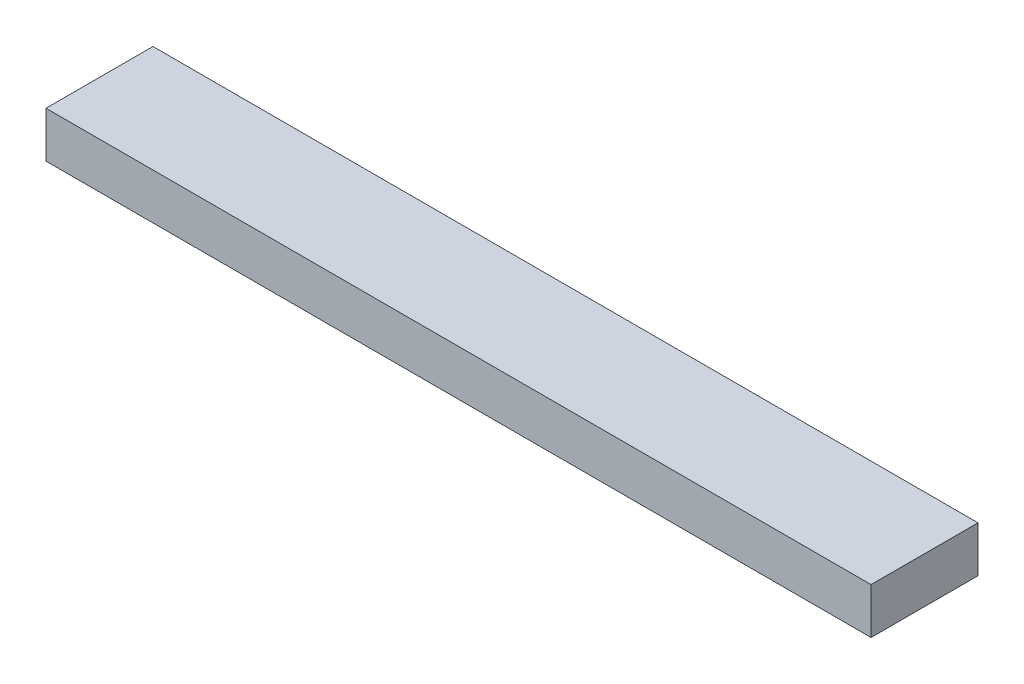
ISO-10303-21;
HEADER;
FILE_DESCRIPTION(('STEP AP214'),'2;1');
FILE_NAME('part.step','',(''),(''),'','','');
FILE_SCHEMA(('AUTOMOTIVE_DESIGN { 1 0 10303 214 1 1 1 1 }'));
ENDSEC;
DATA;
#1=APPLICATION_CONTEXT('core data for automotive mechanical design processes');
#2=APPLICATION_PROTOCOL_DEFINITION('international standard','automotive_design',2000,#1);
#3=PRODUCT_CONTEXT('',#1,'mechanical');
#4=PRODUCT('Part','Part','',(#3));
#5=PRODUCT_RELATED_PRODUCT_CATEGORY('part','',(#4));
#6=PRODUCT_DEFINITION_FORMATION('','',#4);
#7=PRODUCT_DEFINITION_CONTEXT('part definition',#1,'design');
#8=PRODUCT_DEFINITION('design','',#6,#7);
#9=PRODUCT_DEFINITION_SHAPE('','',#8);
#10=(LENGTH_UNIT() NAMED_UNIT(*) SI_UNIT(.MILLI.,.METRE.));
#11=(NAMED_UNIT(*) PLANE_ANGLE_UNIT() SI_UNIT($,.RADIAN.));
#12=(NAMED_UNIT(*) SI_UNIT($,.STERADIAN.) SOLID_ANGLE_UNIT());
#13=UNCERTAINTY_MEASURE_WITH_UNIT(LENGTH_MEASURE(1.E-05),#10,'distance_accuracy_value','');
#14=(GEOMETRIC_REPRESENTATION_CONTEXT(3) GLOBAL_UNCERTAINTY_ASSIGNED_CONTEXT((#13)) GLOBAL_UNIT_ASSIGNED_CONTEXT((#10,
#11,#12)) REPRESENTATION_CONTEXT('',''));
#15=CARTESIAN_POINT('',(0.,0.,0.));
#16=DIRECTION('',(0.,0.,1.));
#17=DIRECTION('',(1.,0.,0.));
#18=AXIS2_PLACEMENT_3D('',#15,#16,#17);
#19=CARTESIAN_POINT('',(0.,38.1,0.));
#20=DIRECTION('',(1.,0.,0.));
#21=DIRECTION('',(0.,0.,-1.));
#22=AXIS2_PLACEMENT_3D('',#19,#20,#21);
#23=PLANE('',#22);
#24=DIRECTION('',(0.,0.,1.));
#25=VECTOR('',#24,1.);
#26=CARTESIAN_POINT('',(0.,0.,0.));
#27=LINE('',#26,#25);
#28=CARTESIAN_POINT('',(0.,0.,-88.9));
#29=VERTEX_POINT('',#28);
#30=CARTESIAN_POINT('',(0.,0.,0.));
#31=VERTEX_POINT('',#30);
#32=EDGE_CURVE('E102',#29,#31,#27,.T.);
#33=ORIENTED_EDGE('',*,*,#32,.T.);
#34=DIRECTION('',(0.,-1.,0.));
#35=VECTOR('',#34,1.);
#36=CARTESIAN_POINT('',(0.,38.1,0.));
#37=LINE('',#36,#35);
#38=CARTESIAN_POINT('',(0.,38.1,0.));
#39=VERTEX_POINT('',#38);
#40=EDGE_CURVE('E11',#39,#31,#37,.T.);
#41=ORIENTED_EDGE('',*,*,#40,.F.);
#42=DIRECTION('',(0.,0.,1.));
#43=VECTOR('',#42,1.);
#44=CARTESIAN_POINT('',(0.,38.1,0.));
#45=LINE('',#44,#43);
#46=CARTESIAN_POINT('',(0.,38.1,-88.9));
#47=VERTEX_POINT('',#46);
#48=EDGE_CURVE('E90',#47,#39,#45,.T.);
#49=ORIENTED_EDGE('',*,*,#48,.F.);
#50=DIRECTION('',(0.,-1.,0.));
#51=VECTOR('',#50,1.);
#52=CARTESIAN_POINT('',(0.,38.1,-88.9));
#53=LINE('',#52,#51);
#54=EDGE_CURVE('E98',#47,#29,#53,.T.);
#55=ORIENTED_EDGE('',*,*,#54,.T.);
#56=EDGE_LOOP('',(#33,#41,#49,#55));
#57=FACE_BOUND('',#56,.T.);
#58=ADVANCED_FACE('F39',(#57),#23,.F.);
#59=CARTESIAN_POINT('',(0.,38.1,0.));
#60=DIRECTION('',(0.,0.,-1.));
#61=DIRECTION('',(-1.,0.,0.));
#62=AXIS2_PLACEMENT_3D('',#59,#60,#61);
#63=PLANE('',#62);
#64=DIRECTION('',(1.,0.,0.));
#65=VECTOR('',#64,1.);
#66=CARTESIAN_POINT('',(0.,0.,0.));
#67=LINE('',#66,#65);
#68=CARTESIAN_POINT('',(685.8,0.,0.));
#69=VERTEX_POINT('',#68);
#70=EDGE_CURVE('E94',#31,#69,#67,.T.);
#71=ORIENTED_EDGE('',*,*,#70,.T.);
#72=DIRECTION('',(0.,-1.,0.));
#73=VECTOR('',#72,1.);
#74=CARTESIAN_POINT('',(685.8,38.1,0.));
#75=LINE('',#74,#73);
#76=CARTESIAN_POINT('',(685.8,38.1,0.));
#77=VERTEX_POINT('',#76);
#78=EDGE_CURVE('E47',#77,#69,#75,.T.);
#79=ORIENTED_EDGE('',*,*,#78,.F.);
#80=DIRECTION('',(1.,0.,0.));
#81=VECTOR('',#80,1.);
#82=CARTESIAN_POINT('',(0.,38.1,0.));
#83=LINE('',#82,#81);
#84=EDGE_CURVE('E85',#39,#77,#83,.T.);
#85=ORIENTED_EDGE('',*,*,#84,.F.);
#86=ORIENTED_EDGE('',*,*,#40,.T.);
#87=EDGE_LOOP('',(#71,#79,#85,#86));
#88=FACE_BOUND('',#87,.T.);
#89=ADVANCED_FACE('F93',(#88),#63,.F.);
#90=CARTESIAN_POINT('',(685.8,38.1,0.));
#91=DIRECTION('',(-1.,0.,0.));
#92=DIRECTION('',(0.,0.,1.));
#93=AXIS2_PLACEMENT_3D('',#90,#91,#92);
#94=PLANE('',#93);
#95=DIRECTION('',(0.,0.,-1.));
#96=VECTOR('',#95,1.);
#97=CARTESIAN_POINT('',(685.8,0.,0.));
#98=LINE('',#97,#96);
#99=CARTESIAN_POINT('',(685.8,0.,-88.9));
#100=VERTEX_POINT('',#99);
#101=EDGE_CURVE('E72',#69,#100,#98,.T.);
#102=ORIENTED_EDGE('',*,*,#101,.T.);
#103=DIRECTION('',(0.,-1.,0.));
#104=VECTOR('',#103,1.);
#105=CARTESIAN_POINT('',(685.8,38.1,-88.9));
#106=LINE('',#105,#104);
#107=CARTESIAN_POINT('',(685.8,38.1,-88.9));
#108=VERTEX_POINT('',#107);
#109=EDGE_CURVE('E95',#108,#100,#106,.T.);
#110=ORIENTED_EDGE('',*,*,#109,.F.);
#111=DIRECTION('',(0.,0.,-1.));
#112=VECTOR('',#111,1.);
#113=CARTESIAN_POINT('',(685.8,38.1,0.));
#114=LINE('',#113,#112);
#115=EDGE_CURVE('E88',#77,#108,#114,.T.);
#116=ORIENTED_EDGE('',*,*,#115,.F.);
#117=ORIENTED_EDGE('',*,*,#78,.T.);
#118=EDGE_LOOP('',(#102,#110,#116,#117));
#119=FACE_BOUND('',#118,.T.);
#120=ADVANCED_FACE('F96',(#119),#94,.F.);
#121=CARTESIAN_POINT('',(0.,38.1,-88.9));
#122=DIRECTION('',(0.,0.,1.));
#123=DIRECTION('',(1.,0.,0.));
#124=AXIS2_PLACEMENT_3D('',#121,#122,#123);
#125=PLANE('',#124);
#126=DIRECTION('',(-1.,0.,0.));
#127=VECTOR('',#126,1.);
#128=CARTESIAN_POINT('',(0.,0.,-88.9));
#129=LINE('',#128,#127);
#130=EDGE_CURVE('E78',#100,#29,#129,.T.);
#131=ORIENTED_EDGE('',*,*,#130,.T.);
#132=ORIENTED_EDGE('',*,*,#54,.F.);
#133=DIRECTION('',(-1.,0.,0.));
#134=VECTOR('',#133,1.);
#135=CARTESIAN_POINT('',(0.,38.1,-88.9));
#136=LINE('',#135,#134);
#137=EDGE_CURVE('E55',#108,#47,#136,.T.);
#138=ORIENTED_EDGE('',*,*,#137,.F.);
#139=ORIENTED_EDGE('',*,*,#109,.T.);
#140=EDGE_LOOP('',(#131,#132,#138,#139));
#141=FACE_BOUND('',#140,.T.);
#142=ADVANCED_FACE('F109',(#141),#125,.F.);
#143=CARTESIAN_POINT('',(0.,38.1,0.));
#144=DIRECTION('',(0.,-1.,0.));
#145=DIRECTION('',(0.,0.,-1.));
#146=AXIS2_PLACEMENT_3D('',#143,#144,#145);
#147=PLANE('',#146);
#148=ORIENTED_EDGE('',*,*,#48,.T.);
#149=ORIENTED_EDGE('',*,*,#84,.T.);
#150=ORIENTED_EDGE('',*,*,#115,.T.);
#151=ORIENTED_EDGE('',*,*,#137,.T.);
#152=EDGE_LOOP('',(#148,#149,#150,#151));
#153=FACE_BOUND('',#152,.T.);
#154=ADVANCED_FACE('F86',(#153),#147,.F.);
#155=CARTESIAN_POINT('',(0.,0.,0.));
#156=DIRECTION('',(0.,-1.,0.));
#157=DIRECTION('',(0.,0.,-1.));
#158=AXIS2_PLACEMENT_3D('',#155,#156,#157);
#159=PLANE('',#158);
#160=ORIENTED_EDGE('',*,*,#32,.F.);
#161=ORIENTED_EDGE('',*,*,#130,.F.);
#162=ORIENTED_EDGE('',*,*,#101,.F.);
#163=ORIENTED_EDGE('',*,*,#70,.F.);
#164=EDGE_LOOP('',(#160,#161,#162,#163));
#165=FACE_BOUND('',#164,.T.);
#166=ADVANCED_FACE('F112',(#165),#159,.T.);
#167=CLOSED_SHELL('',(#58,#89,#120,#142,#154,#166));
#168=MANIFOLD_SOLID_BREP('B2',#167);
#169=ADVANCED_BREP_SHAPE_REPRESENTATION('',(#18,#168),#14);
#170=SHAPE_DEFINITION_REPRESENTATION(#9,#169);
ENDSEC;
END-ISO-10303-21;
